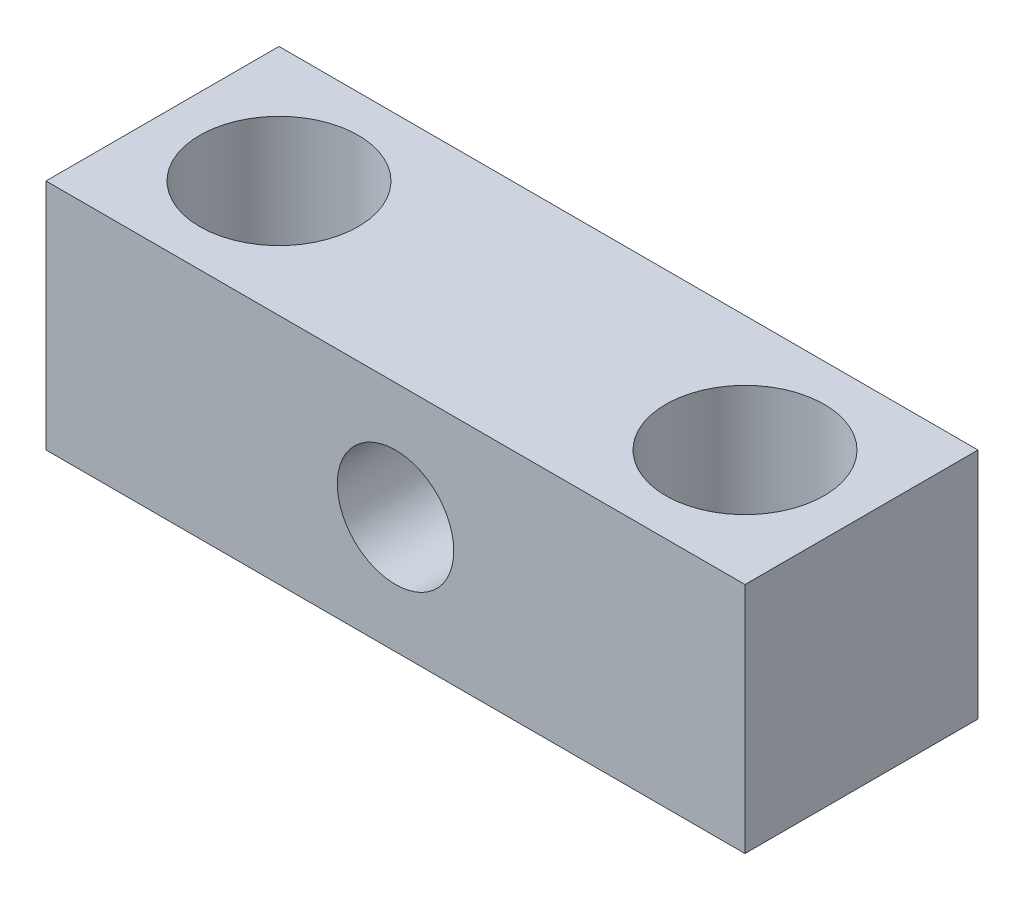
ISO-10303-21;
HEADER;
FILE_DESCRIPTION(('STEP AP214'),'2;1');
FILE_NAME('part.step','',(''),(''),'','','');
FILE_SCHEMA(('AUTOMOTIVE_DESIGN { 1 0 10303 214 1 1 1 1 }'));
ENDSEC;
DATA;
#1=APPLICATION_CONTEXT('core data for automotive mechanical design processes');
#2=APPLICATION_PROTOCOL_DEFINITION('international standard','automotive_design',2000,#1);
#3=PRODUCT_CONTEXT('',#1,'mechanical');
#4=PRODUCT('Part','Part','',(#3));
#5=PRODUCT_RELATED_PRODUCT_CATEGORY('part','',(#4));
#6=PRODUCT_DEFINITION_FORMATION('','',#4);
#7=PRODUCT_DEFINITION_CONTEXT('part definition',#1,'design');
#8=PRODUCT_DEFINITION('design','',#6,#7);
#9=PRODUCT_DEFINITION_SHAPE('','',#8);
#10=(LENGTH_UNIT() NAMED_UNIT(*) SI_UNIT(.MILLI.,.METRE.));
#11=(NAMED_UNIT(*) PLANE_ANGLE_UNIT() SI_UNIT($,.RADIAN.));
#12=(NAMED_UNIT(*) SI_UNIT($,.STERADIAN.) SOLID_ANGLE_UNIT());
#13=UNCERTAINTY_MEASURE_WITH_UNIT(LENGTH_MEASURE(1.E-05),#10,'distance_accuracy_value','');
#14=(GEOMETRIC_REPRESENTATION_CONTEXT(3) GLOBAL_UNCERTAINTY_ASSIGNED_CONTEXT((#13)) GLOBAL_UNIT_ASSIGNED_CONTEXT((#10,
#11,#12)) REPRESENTATION_CONTEXT('',''));
#15=CARTESIAN_POINT('',(0.,0.,0.));
#16=DIRECTION('',(0.,0.,1.));
#17=DIRECTION('',(1.,0.,0.));
#18=AXIS2_PLACEMENT_3D('',#15,#16,#17);
#19=CARTESIAN_POINT('',(7.5,5.,2.5));
#20=DIRECTION('',(-1.,0.,0.));
#21=DIRECTION('',(0.,0.,1.));
#22=AXIS2_PLACEMENT_3D('',#19,#20,#21);
#23=PLANE('',#22);
#24=DIRECTION('',(0.,0.,-1.));
#25=VECTOR('',#24,1.);
#26=CARTESIAN_POINT('',(7.5,0.,2.5));
#27=LINE('',#26,#25);
#28=CARTESIAN_POINT('',(7.5,0.,2.5));
#29=VERTEX_POINT('',#28);
#30=CARTESIAN_POINT('',(7.5,0.,-2.5));
#31=VERTEX_POINT('',#30);
#32=EDGE_CURVE('E95',#29,#31,#27,.T.);
#33=ORIENTED_EDGE('',*,*,#32,.T.);
#34=DIRECTION('',(0.,-1.,0.));
#35=VECTOR('',#34,1.);
#36=CARTESIAN_POINT('',(7.5,5.,-2.5));
#37=LINE('',#36,#35);
#38=CARTESIAN_POINT('',(7.5,5.,-2.5));
#39=VERTEX_POINT('',#38);
#40=EDGE_CURVE('E11',#39,#31,#37,.T.);
#41=ORIENTED_EDGE('',*,*,#40,.F.);
#42=DIRECTION('',(0.,0.,-1.));
#43=VECTOR('',#42,1.);
#44=CARTESIAN_POINT('',(7.5,5.,2.5));
#45=LINE('',#44,#43);
#46=CARTESIAN_POINT('',(7.5,5.,2.5));
#47=VERTEX_POINT('',#46);
#48=EDGE_CURVE('E83',#47,#39,#45,.T.);
#49=ORIENTED_EDGE('',*,*,#48,.F.);
#50=DIRECTION('',(0.,-1.,0.));
#51=VECTOR('',#50,1.);
#52=CARTESIAN_POINT('',(7.5,5.,2.5));
#53=LINE('',#52,#51);
#54=EDGE_CURVE('E91',#47,#29,#53,.T.);
#55=ORIENTED_EDGE('',*,*,#54,.T.);
#56=EDGE_LOOP('',(#33,#41,#49,#55));
#57=FACE_BOUND('',#56,.T.);
#58=ADVANCED_FACE('F32',(#57),#23,.F.);
#59=CARTESIAN_POINT('',(-7.5,5.,-2.5));
#60=DIRECTION('',(0.,0.,1.));
#61=DIRECTION('',(1.,0.,0.));
#62=AXIS2_PLACEMENT_3D('',#59,#60,#61);
#63=PLANE('',#62);
#64=CARTESIAN_POINT('',(0.,2.5,-2.5));
#65=DIRECTION('',(0.,0.,1.));
#66=DIRECTION('',(1.,0.,0.));
#67=AXIS2_PLACEMENT_3D('',#64,#65,#66);
#68=CIRCLE('',#67,1.25);
#69=CARTESIAN_POINT('',(1.25,2.5,-2.5));
#70=VERTEX_POINT('',#69);
#71=EDGE_CURVE('E113',#70,#70,#68,.T.);
#72=ORIENTED_EDGE('',*,*,#71,.T.);
#73=EDGE_LOOP('',(#72));
#74=FACE_BOUND('',#73,.T.);
#75=DIRECTION('',(-1.,0.,0.));
#76=VECTOR('',#75,1.);
#77=CARTESIAN_POINT('',(-7.5,0.,-2.5));
#78=LINE('',#77,#76);
#79=CARTESIAN_POINT('',(-7.5,0.,-2.5));
#80=VERTEX_POINT('',#79);
#81=EDGE_CURVE('E87',#31,#80,#78,.T.);
#82=ORIENTED_EDGE('',*,*,#81,.T.);
#83=DIRECTION('',(0.,-1.,0.));
#84=VECTOR('',#83,1.);
#85=CARTESIAN_POINT('',(-7.5,5.,-2.5));
#86=LINE('',#85,#84);
#87=CARTESIAN_POINT('',(-7.5,5.,-2.5));
#88=VERTEX_POINT('',#87);
#89=EDGE_CURVE('E40',#88,#80,#86,.T.);
#90=ORIENTED_EDGE('',*,*,#89,.F.);
#91=DIRECTION('',(-1.,0.,0.));
#92=VECTOR('',#91,1.);
#93=CARTESIAN_POINT('',(-7.5,5.,-2.5));
#94=LINE('',#93,#92);
#95=EDGE_CURVE('E78',#39,#88,#94,.T.);
#96=ORIENTED_EDGE('',*,*,#95,.F.);
#97=ORIENTED_EDGE('',*,*,#40,.T.);
#98=EDGE_LOOP('',(#82,#90,#96,#97));
#99=FACE_BOUND('',#98,.T.);
#100=ADVANCED_FACE('F86',(#74,#99),#63,.F.);
#101=CARTESIAN_POINT('',(-7.5,5.,2.5));
#102=DIRECTION('',(1.,0.,0.));
#103=DIRECTION('',(0.,0.,-1.));
#104=AXIS2_PLACEMENT_3D('',#101,#102,#103);
#105=PLANE('',#104);
#106=DIRECTION('',(0.,0.,1.));
#107=VECTOR('',#106,1.);
#108=CARTESIAN_POINT('',(-7.5,0.,2.5));
#109=LINE('',#108,#107);
#110=CARTESIAN_POINT('',(-7.5,0.,2.5));
#111=VERTEX_POINT('',#110);
#112=EDGE_CURVE('E65',#80,#111,#109,.T.);
#113=ORIENTED_EDGE('',*,*,#112,.T.);
#114=DIRECTION('',(0.,-1.,0.));
#115=VECTOR('',#114,1.);
#116=CARTESIAN_POINT('',(-7.5,5.,2.5));
#117=LINE('',#116,#115);
#118=CARTESIAN_POINT('',(-7.5,5.,2.5));
#119=VERTEX_POINT('',#118);
#120=EDGE_CURVE('E88',#119,#111,#117,.T.);
#121=ORIENTED_EDGE('',*,*,#120,.F.);
#122=DIRECTION('',(0.,0.,1.));
#123=VECTOR('',#122,1.);
#124=CARTESIAN_POINT('',(-7.5,5.,2.5));
#125=LINE('',#124,#123);
#126=EDGE_CURVE('E81',#88,#119,#125,.T.);
#127=ORIENTED_EDGE('',*,*,#126,.F.);
#128=ORIENTED_EDGE('',*,*,#89,.T.);
#129=EDGE_LOOP('',(#113,#121,#127,#128));
#130=FACE_BOUND('',#129,.T.);
#131=ADVANCED_FACE('F89',(#130),#105,.F.);
#132=CARTESIAN_POINT('',(-7.5,5.,2.5));
#133=DIRECTION('',(0.,0.,-1.));
#134=DIRECTION('',(-1.,0.,0.));
#135=AXIS2_PLACEMENT_3D('',#132,#133,#134);
#136=PLANE('',#135);
#137=CARTESIAN_POINT('',(0.,2.5,2.5));
#138=DIRECTION('',(0.,0.,1.));
#139=DIRECTION('',(1.,0.,0.));
#140=AXIS2_PLACEMENT_3D('',#137,#138,#139);
#141=CIRCLE('',#140,1.25);
#142=CARTESIAN_POINT('',(1.25,2.5,2.5));
#143=VERTEX_POINT('',#142);
#144=EDGE_CURVE('E121',#143,#143,#141,.T.);
#145=ORIENTED_EDGE('',*,*,#144,.F.);
#146=EDGE_LOOP('',(#145));
#147=FACE_BOUND('',#146,.T.);
#148=DIRECTION('',(1.,0.,0.));
#149=VECTOR('',#148,1.);
#150=CARTESIAN_POINT('',(-7.5,0.,2.5));
#151=LINE('',#150,#149);
#152=EDGE_CURVE('E71',#111,#29,#151,.T.);
#153=ORIENTED_EDGE('',*,*,#152,.T.);
#154=ORIENTED_EDGE('',*,*,#54,.F.);
#155=DIRECTION('',(1.,0.,0.));
#156=VECTOR('',#155,1.);
#157=CARTESIAN_POINT('',(-7.5,5.,2.5));
#158=LINE('',#157,#156);
#159=EDGE_CURVE('E48',#119,#47,#158,.T.);
#160=ORIENTED_EDGE('',*,*,#159,.F.);
#161=ORIENTED_EDGE('',*,*,#120,.T.);
#162=EDGE_LOOP('',(#153,#154,#160,#161));
#163=FACE_BOUND('',#162,.T.);
#164=ADVANCED_FACE('F103',(#147,#163),#136,.F.);
#165=CARTESIAN_POINT('',(0.,5.,0.));
#166=DIRECTION('',(0.,-1.,0.));
#167=DIRECTION('',(0.,0.,-1.));
#168=AXIS2_PLACEMENT_3D('',#165,#166,#167);
#169=PLANE('',#168);
#170=CARTESIAN_POINT('',(-5.,5.,0.));
#171=DIRECTION('',(0.,1.,0.));
#172=DIRECTION('',(0.,0.,1.));
#173=AXIS2_PLACEMENT_3D('',#170,#171,#172);
#174=CIRCLE('',#173,1.7);
#175=CARTESIAN_POINT('',(-5.,5.,1.7));
#176=VERTEX_POINT('',#175);
#177=EDGE_CURVE('E116',#176,#176,#174,.T.);
#178=ORIENTED_EDGE('',*,*,#177,.F.);
#179=EDGE_LOOP('',(#178));
#180=FACE_BOUND('',#179,.T.);
#181=CARTESIAN_POINT('',(5.,5.,0.));
#182=DIRECTION('',(0.,1.,0.));
#183=DIRECTION('',(0.,0.,1.));
#184=AXIS2_PLACEMENT_3D('',#181,#182,#183);
#185=CIRCLE('',#184,1.7);
#186=CARTESIAN_POINT('',(5.,5.,1.7));
#187=VERTEX_POINT('',#186);
#188=EDGE_CURVE('E109',#187,#187,#185,.T.);
#189=ORIENTED_EDGE('',*,*,#188,.F.);
#190=EDGE_LOOP('',(#189));
#191=FACE_BOUND('',#190,.T.);
#192=ORIENTED_EDGE('',*,*,#48,.T.);
#193=ORIENTED_EDGE('',*,*,#95,.T.);
#194=ORIENTED_EDGE('',*,*,#126,.T.);
#195=ORIENTED_EDGE('',*,*,#159,.T.);
#196=EDGE_LOOP('',(#192,#193,#194,#195));
#197=FACE_BOUND('',#196,.T.);
#198=ADVANCED_FACE('F79',(#180,#191,#197),#169,.F.);
#199=CARTESIAN_POINT('',(0.,0.,0.));
#200=DIRECTION('',(0.,-1.,0.));
#201=DIRECTION('',(0.,0.,-1.));
#202=AXIS2_PLACEMENT_3D('',#199,#200,#201);
#203=PLANE('',#202);
#204=CARTESIAN_POINT('',(-5.,0.,0.));
#205=DIRECTION('',(0.,1.,0.));
#206=DIRECTION('',(0.,0.,1.));
#207=AXIS2_PLACEMENT_3D('',#204,#205,#206);
#208=CIRCLE('',#207,1.7);
#209=CARTESIAN_POINT('',(-5.,0.,1.7));
#210=VERTEX_POINT('',#209);
#211=EDGE_CURVE('E98',#210,#210,#208,.T.);
#212=ORIENTED_EDGE('',*,*,#211,.T.);
#213=EDGE_LOOP('',(#212));
#214=FACE_BOUND('',#213,.T.);
#215=CARTESIAN_POINT('',(5.,0.,0.));
#216=DIRECTION('',(0.,1.,0.));
#217=DIRECTION('',(0.,0.,1.));
#218=AXIS2_PLACEMENT_3D('',#215,#216,#217);
#219=CIRCLE('',#218,1.7);
#220=CARTESIAN_POINT('',(5.,0.,1.7));
#221=VERTEX_POINT('',#220);
#222=EDGE_CURVE('E112',#221,#221,#219,.T.);
#223=ORIENTED_EDGE('',*,*,#222,.T.);
#224=EDGE_LOOP('',(#223));
#225=FACE_BOUND('',#224,.T.);
#226=ORIENTED_EDGE('',*,*,#32,.F.);
#227=ORIENTED_EDGE('',*,*,#152,.F.);
#228=ORIENTED_EDGE('',*,*,#112,.F.);
#229=ORIENTED_EDGE('',*,*,#81,.F.);
#230=EDGE_LOOP('',(#226,#227,#228,#229));
#231=FACE_BOUND('',#230,.T.);
#232=ADVANCED_FACE('F106',(#214,#225,#231),#203,.T.);
#233=CARTESIAN_POINT('',(5.,0.,0.));
#234=DIRECTION('',(0.,1.,0.));
#235=DIRECTION('',(0.,0.,1.));
#236=AXIS2_PLACEMENT_3D('',#233,#234,#235);
#237=CYLINDRICAL_SURFACE('',#236,1.7);
#238=ORIENTED_EDGE('',*,*,#222,.F.);
#239=EDGE_LOOP('',(#238));
#240=FACE_BOUND('',#239,.T.);
#241=ORIENTED_EDGE('',*,*,#188,.T.);
#242=EDGE_LOOP('',(#241));
#243=FACE_BOUND('',#242,.T.);
#244=ADVANCED_FACE('F174',(#240,#243),#237,.F.);
#245=CARTESIAN_POINT('',(-5.,0.,0.));
#246=DIRECTION('',(0.,1.,0.));
#247=DIRECTION('',(0.,0.,1.));
#248=AXIS2_PLACEMENT_3D('',#245,#246,#247);
#249=CYLINDRICAL_SURFACE('',#248,1.7);
#250=ORIENTED_EDGE('',*,*,#211,.F.);
#251=EDGE_LOOP('',(#250));
#252=FACE_BOUND('',#251,.T.);
#253=ORIENTED_EDGE('',*,*,#177,.T.);
#254=EDGE_LOOP('',(#253));
#255=FACE_BOUND('',#254,.T.);
#256=ADVANCED_FACE('F131',(#252,#255),#249,.F.);
#257=CARTESIAN_POINT('',(0.,2.5,-2.5));
#258=DIRECTION('',(0.,0.,1.));
#259=DIRECTION('',(1.,0.,0.));
#260=AXIS2_PLACEMENT_3D('',#257,#258,#259);
#261=CYLINDRICAL_SURFACE('',#260,1.25);
#262=ORIENTED_EDGE('',*,*,#71,.F.);
#263=EDGE_LOOP('',(#262));
#264=FACE_BOUND('',#263,.T.);
#265=ORIENTED_EDGE('',*,*,#144,.T.);
#266=EDGE_LOOP('',(#265));
#267=FACE_BOUND('',#266,.T.);
#268=ADVANCED_FACE('F128',(#264,#267),#261,.F.);
#269=CLOSED_SHELL('',(#58,#100,#131,#164,#198,#232,#244,#256,#268));
#270=MANIFOLD_SOLID_BREP('B2',#269);
#271=ADVANCED_BREP_SHAPE_REPRESENTATION('',(#18,#270),#14);
#272=SHAPE_DEFINITION_REPRESENTATION(#9,#271);
ENDSEC;
END-ISO-10303-21;
